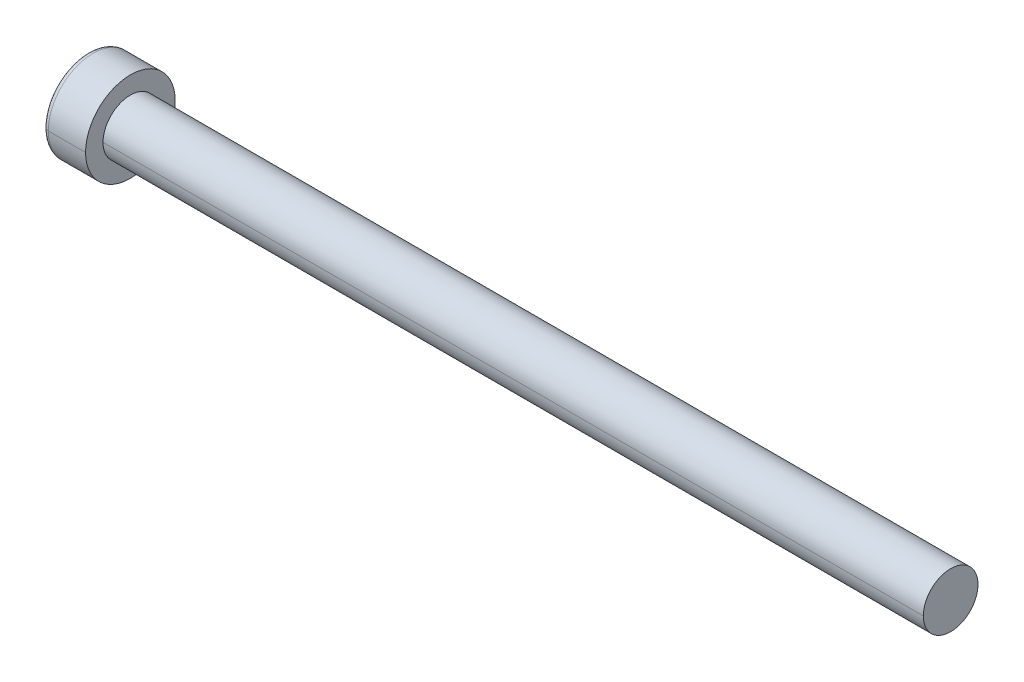
ISO-10303-21;
HEADER;
FILE_DESCRIPTION(('STEP AP214'),'2;1');
FILE_NAME('part.step','',(''),(''),'','','');
FILE_SCHEMA(('AUTOMOTIVE_DESIGN { 1 0 10303 214 1 1 1 1 }'));
ENDSEC;
DATA;
#1=APPLICATION_CONTEXT('core data for automotive mechanical design processes');
#2=APPLICATION_PROTOCOL_DEFINITION('international standard','automotive_design',2000,#1);
#3=PRODUCT_CONTEXT('',#1,'mechanical');
#4=PRODUCT('Part','Part','',(#3));
#5=PRODUCT_RELATED_PRODUCT_CATEGORY('part','',(#4));
#6=PRODUCT_DEFINITION_FORMATION('','',#4);
#7=PRODUCT_DEFINITION_CONTEXT('part definition',#1,'design');
#8=PRODUCT_DEFINITION('design','',#6,#7);
#9=PRODUCT_DEFINITION_SHAPE('','',#8);
#10=(LENGTH_UNIT() NAMED_UNIT(*) SI_UNIT(.MILLI.,.METRE.));
#11=(NAMED_UNIT(*) PLANE_ANGLE_UNIT() SI_UNIT($,.RADIAN.));
#12=(NAMED_UNIT(*) SI_UNIT($,.STERADIAN.) SOLID_ANGLE_UNIT());
#13=UNCERTAINTY_MEASURE_WITH_UNIT(LENGTH_MEASURE(1.E-05),#10,'distance_accuracy_value','');
#14=(GEOMETRIC_REPRESENTATION_CONTEXT(3) GLOBAL_UNCERTAINTY_ASSIGNED_CONTEXT((#13)) GLOBAL_UNIT_ASSIGNED_CONTEXT((#10,
#11,#12)) REPRESENTATION_CONTEXT('',''));
#15=CARTESIAN_POINT('',(0.,0.,0.));
#16=DIRECTION('',(0.,0.,1.));
#17=DIRECTION('',(1.,0.,0.));
#18=AXIS2_PLACEMENT_3D('',#15,#16,#17);
#19=CARTESIAN_POINT('',(0.5,0.,0.));
#20=DIRECTION('',(1.,0.,0.));
#21=DIRECTION('',(0.,0.,-1.));
#22=AXIS2_PLACEMENT_3D('',#19,#20,#21);
#23=TOROIDAL_SURFACE('',#22,3.6,0.5);
#24=CARTESIAN_POINT('',(0.5,0.,3.6));
#25=DIRECTION('',(0.,1.,0.));
#26=DIRECTION('',(0.,0.,1.));
#27=AXIS2_PLACEMENT_3D('',#24,#25,#26);
#28=CIRCLE('',#27,0.5);
#29=CARTESIAN_POINT('',(0.,0.,3.6));
#30=VERTEX_POINT('',#29);
#31=CARTESIAN_POINT('',(0.5,0.,4.1));
#32=VERTEX_POINT('',#31);
#33=EDGE_CURVE('E141',#30,#32,#28,.T.);
#34=ORIENTED_EDGE('',*,*,#33,.F.);
#35=CARTESIAN_POINT('',(0.,0.,0.));
#36=DIRECTION('',(-1.,0.,0.));
#37=DIRECTION('',(0.,0.,-1.));
#38=AXIS2_PLACEMENT_3D('',#35,#36,#37);
#39=CIRCLE('',#38,3.6);
#40=CARTESIAN_POINT('',(0.,0.,-3.6));
#41=VERTEX_POINT('',#40);
#42=EDGE_CURVE('E128',#41,#30,#39,.T.);
#43=ORIENTED_EDGE('',*,*,#42,.F.);
#44=CARTESIAN_POINT('',(0.5,0.,-3.6));
#45=DIRECTION('',(0.,-1.,0.));
#46=DIRECTION('',(0.,0.,-1.));
#47=AXIS2_PLACEMENT_3D('',#44,#45,#46);
#48=CIRCLE('',#47,0.5);
#49=CARTESIAN_POINT('',(0.5,0.,-4.1));
#50=VERTEX_POINT('',#49);
#51=EDGE_CURVE('E150',#41,#50,#48,.T.);
#52=ORIENTED_EDGE('',*,*,#51,.T.);
#53=CARTESIAN_POINT('',(0.5,0.,0.));
#54=DIRECTION('',(1.,0.,0.));
#55=DIRECTION('',(0.,0.,-1.));
#56=AXIS2_PLACEMENT_3D('',#53,#54,#55);
#57=CIRCLE('',#56,4.1);
#58=EDGE_CURVE('E142',#32,#50,#57,.T.);
#59=ORIENTED_EDGE('',*,*,#58,.F.);
#60=EDGE_LOOP('',(#34,#43,#52,#59));
#61=FACE_BOUND('',#60,.T.);
#62=ADVANCED_FACE('F17',(#61),#23,.T.);
#63=CARTESIAN_POINT('',(2.,0.,0.));
#64=DIRECTION('',(-1.,0.,0.));
#65=DIRECTION('',(0.,0.,1.));
#66=AXIS2_PLACEMENT_3D('',#63,#64,#65);
#67=PLANE('',#66);
#68=DIRECTION('',(0.,-0.866025403784439,-0.5));
#69=VECTOR('',#68,1.);
#70=CARTESIAN_POINT('',(2.,2.,-1.15470053837925));
#71=LINE('',#70,#69);
#72=CARTESIAN_POINT('',(2.,2.,-1.15470053837925));
#73=VERTEX_POINT('',#72);
#74=CARTESIAN_POINT('',(2.,0.,-2.30940107675851));
#75=VERTEX_POINT('',#74);
#76=EDGE_CURVE('E204',#73,#75,#71,.T.);
#77=ORIENTED_EDGE('',*,*,#76,.T.);
#78=DIRECTION('',(0.,-0.866025403784439,0.5));
#79=VECTOR('',#78,1.);
#80=CARTESIAN_POINT('',(2.,0.,-2.30940107675851));
#81=LINE('',#80,#79);
#82=CARTESIAN_POINT('',(2.,-2.,-1.15470053837925));
#83=VERTEX_POINT('',#82);
#84=EDGE_CURVE('E11',#75,#83,#81,.T.);
#85=ORIENTED_EDGE('',*,*,#84,.T.);
#86=DIRECTION('',(0.,0.,1.));
#87=VECTOR('',#86,1.);
#88=CARTESIAN_POINT('',(2.,-2.,-1.15470053837925));
#89=LINE('',#88,#87);
#90=CARTESIAN_POINT('',(2.,-2.,1.15470053837925));
#91=VERTEX_POINT('',#90);
#92=EDGE_CURVE('E45',#83,#91,#89,.T.);
#93=ORIENTED_EDGE('',*,*,#92,.T.);
#94=DIRECTION('',(0.,0.866025403784439,0.5));
#95=VECTOR('',#94,1.);
#96=CARTESIAN_POINT('',(2.,-2.,1.15470053837925));
#97=LINE('',#96,#95);
#98=CARTESIAN_POINT('',(2.,0.,2.30940107675851));
#99=VERTEX_POINT('',#98);
#100=EDGE_CURVE('E242',#91,#99,#97,.T.);
#101=ORIENTED_EDGE('',*,*,#100,.T.);
#102=DIRECTION('',(0.,0.866025403784439,-0.5));
#103=VECTOR('',#102,1.);
#104=CARTESIAN_POINT('',(2.,0.,2.30940107675851));
#105=LINE('',#104,#103);
#106=CARTESIAN_POINT('',(2.,2.,1.15470053837925));
#107=VERTEX_POINT('',#106);
#108=EDGE_CURVE('E236',#99,#107,#105,.T.);
#109=ORIENTED_EDGE('',*,*,#108,.T.);
#110=DIRECTION('',(0.,0.,-1.));
#111=VECTOR('',#110,1.);
#112=CARTESIAN_POINT('',(2.,2.,1.15470053837925));
#113=LINE('',#112,#111);
#114=EDGE_CURVE('E230',#107,#73,#113,.T.);
#115=ORIENTED_EDGE('',*,*,#114,.T.);
#116=EDGE_LOOP('',(#77,#85,#93,#101,#109,#115));
#117=FACE_BOUND('',#116,.T.);
#118=ADVANCED_FACE('F19',(#117),#67,.T.);
#119=CARTESIAN_POINT('',(2.,0.,-2.30940107675851));
#120=DIRECTION('',(0.,-0.5,-0.866025403784439));
#121=DIRECTION('',(0.,-0.866025403784439,0.5));
#122=AXIS2_PLACEMENT_3D('',#119,#120,#121);
#123=PLANE('',#122);
#124=DIRECTION('',(0.,-0.866025403784439,0.5));
#125=VECTOR('',#124,1.);
#126=CARTESIAN_POINT('',(0.,0.,-2.30940107675851));
#127=LINE('',#126,#125);
#128=CARTESIAN_POINT('',(0.,0.,-2.30940107675851));
#129=VERTEX_POINT('',#128);
#130=CARTESIAN_POINT('',(0.,-2.,-1.15470053837925));
#131=VERTEX_POINT('',#130);
#132=EDGE_CURVE('E137',#129,#131,#127,.T.);
#133=ORIENTED_EDGE('',*,*,#132,.T.);
#134=DIRECTION('',(-1.,0.,0.));
#135=VECTOR('',#134,1.);
#136=CARTESIAN_POINT('',(2.,-2.,-1.15470053837925));
#137=LINE('',#136,#135);
#138=EDGE_CURVE('E26',#83,#131,#137,.T.);
#139=ORIENTED_EDGE('',*,*,#138,.F.);
#140=ORIENTED_EDGE('',*,*,#84,.F.);
#141=DIRECTION('',(-1.,0.,0.));
#142=VECTOR('',#141,1.);
#143=CARTESIAN_POINT('',(2.,0.,-2.30940107675851));
#144=LINE('',#143,#142);
#145=EDGE_CURVE('E208',#75,#129,#144,.T.);
#146=ORIENTED_EDGE('',*,*,#145,.T.);
#147=EDGE_LOOP('',(#133,#139,#140,#146));
#148=FACE_BOUND('',#147,.T.);
#149=ADVANCED_FACE('F258',(#148),#123,.F.);
#150=CARTESIAN_POINT('',(2.,-2.,-1.15470053837925));
#151=DIRECTION('',(0.,-1.,0.));
#152=DIRECTION('',(-1.,0.,0.));
#153=AXIS2_PLACEMENT_3D('',#150,#151,#152);
#154=PLANE('',#153);
#155=DIRECTION('',(0.,0.,1.));
#156=VECTOR('',#155,1.);
#157=CARTESIAN_POINT('',(0.,-2.,-1.15470053837925));
#158=LINE('',#157,#156);
#159=CARTESIAN_POINT('',(0.,-2.,1.15470053837925));
#160=VERTEX_POINT('',#159);
#161=EDGE_CURVE('E215',#131,#160,#158,.T.);
#162=ORIENTED_EDGE('',*,*,#161,.T.);
#163=DIRECTION('',(-1.,0.,0.));
#164=VECTOR('',#163,1.);
#165=CARTESIAN_POINT('',(2.,-2.,1.15470053837925));
#166=LINE('',#165,#164);
#167=EDGE_CURVE('E190',#91,#160,#166,.T.);
#168=ORIENTED_EDGE('',*,*,#167,.F.);
#169=ORIENTED_EDGE('',*,*,#92,.F.);
#170=ORIENTED_EDGE('',*,*,#138,.T.);
#171=EDGE_LOOP('',(#162,#168,#169,#170));
#172=FACE_BOUND('',#171,.T.);
#173=ADVANCED_FACE('F251',(#172),#154,.F.);
#174=CARTESIAN_POINT('',(2.,-2.,1.15470053837925));
#175=DIRECTION('',(0.,-0.5,0.866025403784439));
#176=DIRECTION('',(-1.,0.,0.));
#177=AXIS2_PLACEMENT_3D('',#174,#175,#176);
#178=PLANE('',#177);
#179=DIRECTION('',(0.,0.866025403784439,0.5));
#180=VECTOR('',#179,1.);
#181=CARTESIAN_POINT('',(0.,-2.,1.15470053837925));
#182=LINE('',#181,#180);
#183=CARTESIAN_POINT('',(0.,0.,2.30940107675851));
#184=VERTEX_POINT('',#183);
#185=EDGE_CURVE('E163',#160,#184,#182,.T.);
#186=ORIENTED_EDGE('',*,*,#185,.T.);
#187=DIRECTION('',(-1.,0.,0.));
#188=VECTOR('',#187,1.);
#189=CARTESIAN_POINT('',(2.,0.,2.30940107675851));
#190=LINE('',#189,#188);
#191=EDGE_CURVE('E239',#99,#184,#190,.T.);
#192=ORIENTED_EDGE('',*,*,#191,.F.);
#193=ORIENTED_EDGE('',*,*,#100,.F.);
#194=ORIENTED_EDGE('',*,*,#167,.T.);
#195=EDGE_LOOP('',(#186,#192,#193,#194));
#196=FACE_BOUND('',#195,.T.);
#197=ADVANCED_FACE('F275',(#196),#178,.F.);
#198=CARTESIAN_POINT('',(2.,0.,2.30940107675851));
#199=DIRECTION('',(0.,0.5,0.866025403784439));
#200=DIRECTION('',(1.,0.,0.));
#201=AXIS2_PLACEMENT_3D('',#198,#199,#200);
#202=PLANE('',#201);
#203=DIRECTION('',(0.,0.866025403784439,-0.5));
#204=VECTOR('',#203,1.);
#205=CARTESIAN_POINT('',(0.,0.,2.30940107675851));
#206=LINE('',#205,#204);
#207=CARTESIAN_POINT('',(0.,2.,1.15470053837925));
#208=VERTEX_POINT('',#207);
#209=EDGE_CURVE('E159',#184,#208,#206,.T.);
#210=ORIENTED_EDGE('',*,*,#209,.T.);
#211=DIRECTION('',(-1.,0.,0.));
#212=VECTOR('',#211,1.);
#213=CARTESIAN_POINT('',(2.,2.,1.15470053837925));
#214=LINE('',#213,#212);
#215=EDGE_CURVE('E233',#107,#208,#214,.T.);
#216=ORIENTED_EDGE('',*,*,#215,.F.);
#217=ORIENTED_EDGE('',*,*,#108,.F.);
#218=ORIENTED_EDGE('',*,*,#191,.T.);
#219=EDGE_LOOP('',(#210,#216,#217,#218));
#220=FACE_BOUND('',#219,.T.);
#221=ADVANCED_FACE('F271',(#220),#202,.F.);
#222=CARTESIAN_POINT('',(2.,2.,1.15470053837925));
#223=DIRECTION('',(0.,1.,0.));
#224=DIRECTION('',(0.,0.,-1.));
#225=AXIS2_PLACEMENT_3D('',#222,#223,#224);
#226=PLANE('',#225);
#227=DIRECTION('',(0.,0.,-1.));
#228=VECTOR('',#227,1.);
#229=CARTESIAN_POINT('',(0.,2.,1.15470053837925));
#230=LINE('',#229,#228);
#231=CARTESIAN_POINT('',(0.,2.,-1.15470053837925));
#232=VERTEX_POINT('',#231);
#233=EDGE_CURVE('E164',#208,#232,#230,.T.);
#234=ORIENTED_EDGE('',*,*,#233,.T.);
#235=DIRECTION('',(-1.,0.,0.));
#236=VECTOR('',#235,1.);
#237=CARTESIAN_POINT('',(2.,2.,-1.15470053837925));
#238=LINE('',#237,#236);
#239=EDGE_CURVE('E207',#73,#232,#238,.T.);
#240=ORIENTED_EDGE('',*,*,#239,.F.);
#241=ORIENTED_EDGE('',*,*,#114,.F.);
#242=ORIENTED_EDGE('',*,*,#215,.T.);
#243=EDGE_LOOP('',(#234,#240,#241,#242));
#244=FACE_BOUND('',#243,.T.);
#245=ADVANCED_FACE('F266',(#244),#226,.F.);
#246=CARTESIAN_POINT('',(2.,2.,-1.15470053837925));
#247=DIRECTION('',(0.,0.5,-0.866025403784439));
#248=DIRECTION('',(-1.,0.,0.));
#249=AXIS2_PLACEMENT_3D('',#246,#247,#248);
#250=PLANE('',#249);
#251=DIRECTION('',(0.,-0.866025403784439,-0.5));
#252=VECTOR('',#251,1.);
#253=CARTESIAN_POINT('',(0.,2.,-1.15470053837925));
#254=LINE('',#253,#252);
#255=EDGE_CURVE('E175',#232,#129,#254,.T.);
#256=ORIENTED_EDGE('',*,*,#255,.T.);
#257=ORIENTED_EDGE('',*,*,#145,.F.);
#258=ORIENTED_EDGE('',*,*,#76,.F.);
#259=ORIENTED_EDGE('',*,*,#239,.T.);
#260=EDGE_LOOP('',(#256,#257,#258,#259));
#261=FACE_BOUND('',#260,.T.);
#262=ADVANCED_FACE('F262',(#261),#250,.F.);
#263=CARTESIAN_POINT('',(78.91,2.5,0.));
#264=DIRECTION('',(-1.,0.,0.));
#265=DIRECTION('',(0.,0.,1.));
#266=AXIS2_PLACEMENT_3D('',#263,#264,#265);
#267=PLANE('',#266);
#268=CARTESIAN_POINT('',(78.91,0.,0.));
#269=DIRECTION('',(-1.,0.,0.));
#270=DIRECTION('',(0.,0.,1.));
#271=AXIS2_PLACEMENT_3D('',#268,#269,#270);
#272=CIRCLE('',#271,2.5);
#273=CARTESIAN_POINT('',(78.91,0.,2.5));
#274=VERTEX_POINT('',#273);
#275=CARTESIAN_POINT('',(78.91,0.,-2.5));
#276=VERTEX_POINT('',#275);
#277=EDGE_CURVE('E171',#274,#276,#272,.T.);
#278=ORIENTED_EDGE('',*,*,#277,.F.);
#279=CARTESIAN_POINT('',(78.91,0.,0.));
#280=DIRECTION('',(-1.,0.,0.));
#281=DIRECTION('',(0.,0.,1.));
#282=AXIS2_PLACEMENT_3D('',#279,#280,#281);
#283=CIRCLE('',#282,2.5);
#284=EDGE_CURVE('E168',#276,#274,#283,.T.);
#285=ORIENTED_EDGE('',*,*,#284,.F.);
#286=EDGE_LOOP('',(#278,#285));
#287=FACE_BOUND('',#286,.T.);
#288=ADVANCED_FACE('F291',(#287),#267,.F.);
#289=CARTESIAN_POINT('',(0.,0.,0.));
#290=DIRECTION('',(-1.,0.,0.));
#291=DIRECTION('',(0.,0.,1.));
#292=AXIS2_PLACEMENT_3D('',#289,#290,#291);
#293=CYLINDRICAL_SURFACE('',#292,2.5);
#294=DIRECTION('',(-1.,0.,0.));
#295=VECTOR('',#294,1.);
#296=CARTESIAN_POINT('',(0.,0.,-2.5));
#297=LINE('',#296,#295);
#298=CARTESIAN_POINT('',(3.91,0.,-2.5));
#299=VERTEX_POINT('',#298);
#300=EDGE_CURVE('E181',#276,#299,#297,.T.);
#301=ORIENTED_EDGE('',*,*,#300,.F.);
#302=ORIENTED_EDGE('',*,*,#284,.T.);
#303=DIRECTION('',(-1.,0.,0.));
#304=VECTOR('',#303,1.);
#305=CARTESIAN_POINT('',(0.,0.,2.5));
#306=LINE('',#305,#304);
#307=CARTESIAN_POINT('',(3.91,0.,2.5));
#308=VERTEX_POINT('',#307);
#309=EDGE_CURVE('E180',#274,#308,#306,.T.);
#310=ORIENTED_EDGE('',*,*,#309,.T.);
#311=CARTESIAN_POINT('',(3.91,0.,0.));
#312=DIRECTION('',(-1.,0.,0.));
#313=DIRECTION('',(0.,0.,1.));
#314=AXIS2_PLACEMENT_3D('',#311,#312,#313);
#315=CIRCLE('',#314,2.5);
#316=EDGE_CURVE('E165',#299,#308,#315,.T.);
#317=ORIENTED_EDGE('',*,*,#316,.F.);
#318=EDGE_LOOP('',(#301,#302,#310,#317));
#319=FACE_BOUND('',#318,.T.);
#320=ADVANCED_FACE('F294',(#319),#293,.T.);
#321=CARTESIAN_POINT('',(3.91,4.1,0.));
#322=DIRECTION('',(-1.,0.,0.));
#323=DIRECTION('',(0.,0.,1.));
#324=AXIS2_PLACEMENT_3D('',#321,#322,#323);
#325=PLANE('',#324);
#326=CARTESIAN_POINT('',(3.91,0.,0.));
#327=DIRECTION('',(-1.,0.,0.));
#328=DIRECTION('',(0.,0.,1.));
#329=AXIS2_PLACEMENT_3D('',#326,#327,#328);
#330=CIRCLE('',#329,2.5);
#331=EDGE_CURVE('E176',#308,#299,#330,.T.);
#332=ORIENTED_EDGE('',*,*,#331,.T.);
#333=ORIENTED_EDGE('',*,*,#316,.T.);
#334=EDGE_LOOP('',(#332,#333));
#335=FACE_BOUND('',#334,.T.);
#336=CARTESIAN_POINT('',(3.91,0.,0.));
#337=DIRECTION('',(-1.,0.,0.));
#338=DIRECTION('',(0.,0.,1.));
#339=AXIS2_PLACEMENT_3D('',#336,#337,#338);
#340=CIRCLE('',#339,4.1);
#341=CARTESIAN_POINT('',(3.91,0.,4.1));
#342=VERTEX_POINT('',#341);
#343=CARTESIAN_POINT('',(3.91,0.,-4.1));
#344=VERTEX_POINT('',#343);
#345=EDGE_CURVE('E194',#342,#344,#340,.T.);
#346=ORIENTED_EDGE('',*,*,#345,.F.);
#347=CARTESIAN_POINT('',(3.91,0.,0.));
#348=DIRECTION('',(-1.,0.,0.));
#349=DIRECTION('',(0.,0.,1.));
#350=AXIS2_PLACEMENT_3D('',#347,#348,#349);
#351=CIRCLE('',#350,4.1);
#352=EDGE_CURVE('E219',#344,#342,#351,.T.);
#353=ORIENTED_EDGE('',*,*,#352,.F.);
#354=EDGE_LOOP('',(#346,#353));
#355=FACE_BOUND('',#354,.T.);
#356=ADVANCED_FACE('F287',(#335,#355),#325,.F.);
#357=CARTESIAN_POINT('',(0.,0.,0.));
#358=DIRECTION('',(-1.,0.,0.));
#359=DIRECTION('',(0.,0.,1.));
#360=AXIS2_PLACEMENT_3D('',#357,#358,#359);
#361=CYLINDRICAL_SURFACE('',#360,4.1);
#362=DIRECTION('',(-1.,0.,0.));
#363=VECTOR('',#362,1.);
#364=CARTESIAN_POINT('',(0.,0.,-4.1));
#365=LINE('',#364,#363);
#366=EDGE_CURVE('E187',#344,#50,#365,.T.);
#367=ORIENTED_EDGE('',*,*,#366,.F.);
#368=ORIENTED_EDGE('',*,*,#352,.T.);
#369=DIRECTION('',(-1.,0.,0.));
#370=VECTOR('',#369,1.);
#371=CARTESIAN_POINT('',(0.,0.,4.1));
#372=LINE('',#371,#370);
#373=EDGE_CURVE('E138',#342,#32,#372,.T.);
#374=ORIENTED_EDGE('',*,*,#373,.T.);
#375=ORIENTED_EDGE('',*,*,#58,.T.);
#376=EDGE_LOOP('',(#367,#368,#374,#375));
#377=FACE_BOUND('',#376,.T.);
#378=ADVANCED_FACE('F314',(#377),#361,.T.);
#379=CARTESIAN_POINT('',(0.,0.,0.));
#380=DIRECTION('',(1.,0.,0.));
#381=DIRECTION('',(0.,1.,0.));
#382=AXIS2_PLACEMENT_3D('',#379,#380,#381);
#383=PLANE('',#382);
#384=ORIENTED_EDGE('',*,*,#132,.F.);
#385=ORIENTED_EDGE('',*,*,#255,.F.);
#386=ORIENTED_EDGE('',*,*,#233,.F.);
#387=ORIENTED_EDGE('',*,*,#209,.F.);
#388=ORIENTED_EDGE('',*,*,#185,.F.);
#389=ORIENTED_EDGE('',*,*,#161,.F.);
#390=EDGE_LOOP('',(#384,#385,#386,#387,#388,#389));
#391=FACE_BOUND('',#390,.T.);
#392=ORIENTED_EDGE('',*,*,#42,.T.);
#393=CARTESIAN_POINT('',(0.,0.,0.));
#394=DIRECTION('',(-1.,0.,0.));
#395=DIRECTION('',(0.,0.,-1.));
#396=AXIS2_PLACEMENT_3D('',#393,#394,#395);
#397=CIRCLE('',#396,3.6);
#398=EDGE_CURVE('E132',#30,#41,#397,.T.);
#399=ORIENTED_EDGE('',*,*,#398,.T.);
#400=EDGE_LOOP('',(#392,#399));
#401=FACE_BOUND('',#400,.T.);
#402=ADVANCED_FACE('F130',(#391,#401),#383,.F.);
#403=CARTESIAN_POINT('',(0.,0.,0.));
#404=DIRECTION('',(-1.,0.,0.));
#405=DIRECTION('',(0.,0.,1.));
#406=AXIS2_PLACEMENT_3D('',#403,#404,#405);
#407=CYLINDRICAL_SURFACE('',#406,4.1);
#408=ORIENTED_EDGE('',*,*,#345,.T.);
#409=ORIENTED_EDGE('',*,*,#366,.T.);
#410=CARTESIAN_POINT('',(0.5,0.,0.));
#411=DIRECTION('',(1.,0.,0.));
#412=DIRECTION('',(0.,0.,-1.));
#413=AXIS2_PLACEMENT_3D('',#410,#411,#412);
#414=CIRCLE('',#413,4.1);
#415=EDGE_CURVE('E147',#50,#32,#414,.T.);
#416=ORIENTED_EDGE('',*,*,#415,.T.);
#417=ORIENTED_EDGE('',*,*,#373,.F.);
#418=EDGE_LOOP('',(#408,#409,#416,#417));
#419=FACE_BOUND('',#418,.T.);
#420=ADVANCED_FACE('F309',(#419),#407,.T.);
#421=CARTESIAN_POINT('',(0.,0.,0.));
#422=DIRECTION('',(-1.,0.,0.));
#423=DIRECTION('',(0.,0.,1.));
#424=AXIS2_PLACEMENT_3D('',#421,#422,#423);
#425=CYLINDRICAL_SURFACE('',#424,2.5);
#426=ORIENTED_EDGE('',*,*,#277,.T.);
#427=ORIENTED_EDGE('',*,*,#300,.T.);
#428=ORIENTED_EDGE('',*,*,#331,.F.);
#429=ORIENTED_EDGE('',*,*,#309,.F.);
#430=EDGE_LOOP('',(#426,#427,#428,#429));
#431=FACE_BOUND('',#430,.T.);
#432=ADVANCED_FACE('F306',(#431),#425,.T.);
#433=CARTESIAN_POINT('',(0.5,0.,0.));
#434=DIRECTION('',(1.,0.,0.));
#435=DIRECTION('',(0.,0.,-1.));
#436=AXIS2_PLACEMENT_3D('',#433,#434,#435);
#437=TOROIDAL_SURFACE('',#436,3.6,0.5);
#438=ORIENTED_EDGE('',*,*,#398,.F.);
#439=ORIENTED_EDGE('',*,*,#33,.T.);
#440=ORIENTED_EDGE('',*,*,#415,.F.);
#441=ORIENTED_EDGE('',*,*,#51,.F.);
#442=EDGE_LOOP('',(#438,#439,#440,#441));
#443=FACE_BOUND('',#442,.T.);
#444=ADVANCED_FACE('F149',(#443),#437,.T.);
#445=CLOSED_SHELL('',(#62,#118,#149,#173,#197,#221,#245,#262,#288,#320,#356,#378,#402,#420,#432,#444));
#446=MANIFOLD_SOLID_BREP('B1',#445);
#447=ADVANCED_BREP_SHAPE_REPRESENTATION('',(#18,#446),#14);
#448=SHAPE_DEFINITION_REPRESENTATION(#9,#447);
ENDSEC;
END-ISO-10303-21;
